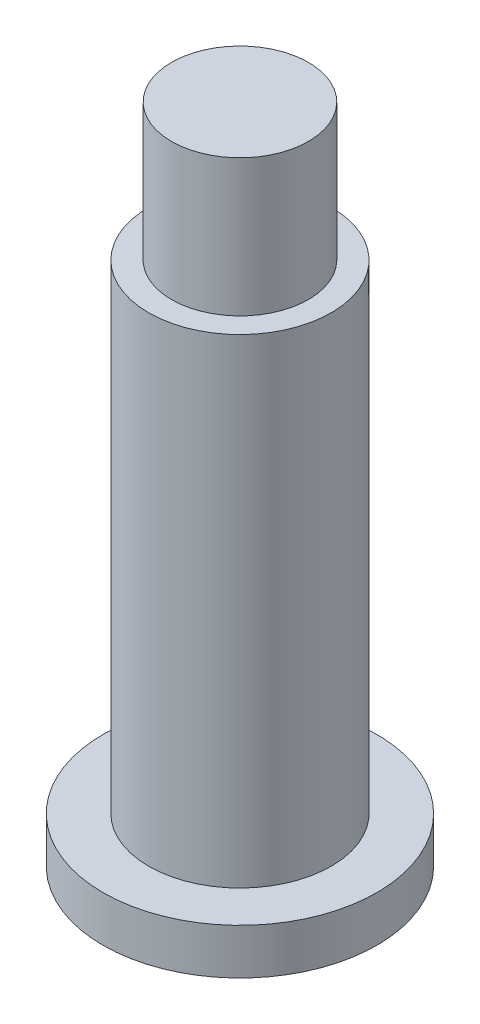
ISO-10303-21;
HEADER;
FILE_DESCRIPTION(('STEP AP214'),'2;1');
FILE_NAME('part.step','',(''),(''),'','','');
FILE_SCHEMA(('AUTOMOTIVE_DESIGN { 1 0 10303 214 1 1 1 1 }'));
ENDSEC;
DATA;
#1=APPLICATION_CONTEXT('core data for automotive mechanical design processes');
#2=APPLICATION_PROTOCOL_DEFINITION('international standard','automotive_design',2000,#1);
#3=PRODUCT_CONTEXT('',#1,'mechanical');
#4=PRODUCT('Part','Part','',(#3));
#5=PRODUCT_RELATED_PRODUCT_CATEGORY('part','',(#4));
#6=PRODUCT_DEFINITION_FORMATION('','',#4);
#7=PRODUCT_DEFINITION_CONTEXT('part definition',#1,'design');
#8=PRODUCT_DEFINITION('design','',#6,#7);
#9=PRODUCT_DEFINITION_SHAPE('','',#8);
#10=(LENGTH_UNIT() NAMED_UNIT(*) SI_UNIT(.MILLI.,.METRE.));
#11=(NAMED_UNIT(*) PLANE_ANGLE_UNIT() SI_UNIT($,.RADIAN.));
#12=(NAMED_UNIT(*) SI_UNIT($,.STERADIAN.) SOLID_ANGLE_UNIT());
#13=UNCERTAINTY_MEASURE_WITH_UNIT(LENGTH_MEASURE(1.E-05),#10,'distance_accuracy_value','');
#14=(GEOMETRIC_REPRESENTATION_CONTEXT(3) GLOBAL_UNCERTAINTY_ASSIGNED_CONTEXT((#13)) GLOBAL_UNIT_ASSIGNED_CONTEXT((#10,
#11,#12)) REPRESENTATION_CONTEXT('',''));
#15=CARTESIAN_POINT('',(0.,0.,0.));
#16=DIRECTION('',(0.,0.,1.));
#17=DIRECTION('',(1.,0.,0.));
#18=AXIS2_PLACEMENT_3D('',#15,#16,#17);
#19=CARTESIAN_POINT('',(0.,23.,0.));
#20=DIRECTION('',(0.,1.,0.));
#21=DIRECTION('',(0.,0.,1.));
#22=AXIS2_PLACEMENT_3D('',#19,#20,#21);
#23=PLANE('',#22);
#24=CARTESIAN_POINT('',(0.,23.,0.));
#25=DIRECTION('',(0.,1.,0.));
#26=DIRECTION('',(0.,0.,1.));
#27=AXIS2_PLACEMENT_3D('',#24,#25,#26);
#28=CIRCLE('',#27,4.);
#29=CARTESIAN_POINT('',(0.,23.,4.));
#30=VERTEX_POINT('',#29);
#31=EDGE_CURVE('E46',#30,#30,#28,.T.);
#32=ORIENTED_EDGE('',*,*,#31,.T.);
#33=EDGE_LOOP('',(#32));
#34=FACE_BOUND('',#33,.T.);
#35=CARTESIAN_POINT('',(0.,23.,0.));
#36=DIRECTION('',(0.,1.,0.));
#37=DIRECTION('',(0.,0.,1.));
#38=AXIS2_PLACEMENT_3D('',#35,#36,#37);
#39=CIRCLE('',#38,3.);
#40=CARTESIAN_POINT('',(0.,23.,3.));
#41=VERTEX_POINT('',#40);
#42=EDGE_CURVE('E54',#41,#41,#39,.T.);
#43=ORIENTED_EDGE('',*,*,#42,.F.);
#44=EDGE_LOOP('',(#43));
#45=FACE_BOUND('',#44,.T.);
#46=ADVANCED_FACE('F35',(#34,#45),#23,.T.);
#47=CARTESIAN_POINT('',(0.,2.,0.));
#48=DIRECTION('',(0.,1.,0.));
#49=DIRECTION('',(0.,0.,1.));
#50=AXIS2_PLACEMENT_3D('',#47,#48,#49);
#51=PLANE('',#50);
#52=CARTESIAN_POINT('',(0.,2.,0.));
#53=DIRECTION('',(0.,1.,0.));
#54=DIRECTION('',(0.,0.,1.));
#55=AXIS2_PLACEMENT_3D('',#52,#53,#54);
#56=CIRCLE('',#55,6.);
#57=CARTESIAN_POINT('',(0.,2.,6.));
#58=VERTEX_POINT('',#57);
#59=EDGE_CURVE('E10',#58,#58,#56,.T.);
#60=ORIENTED_EDGE('',*,*,#59,.T.);
#61=EDGE_LOOP('',(#60));
#62=FACE_BOUND('',#61,.T.);
#63=CARTESIAN_POINT('',(0.,2.,0.));
#64=DIRECTION('',(0.,1.,0.));
#65=DIRECTION('',(0.,0.,1.));
#66=AXIS2_PLACEMENT_3D('',#63,#64,#65);
#67=CIRCLE('',#66,4.);
#68=CARTESIAN_POINT('',(0.,2.,4.));
#69=VERTEX_POINT('',#68);
#70=EDGE_CURVE('E48',#69,#69,#67,.T.);
#71=ORIENTED_EDGE('',*,*,#70,.F.);
#72=EDGE_LOOP('',(#71));
#73=FACE_BOUND('',#72,.T.);
#74=ADVANCED_FACE('F70',(#62,#73),#51,.T.);
#75=CARTESIAN_POINT('',(0.,2.,0.));
#76=DIRECTION('',(0.,-1.,0.));
#77=DIRECTION('',(0.,0.,-1.));
#78=AXIS2_PLACEMENT_3D('',#75,#76,#77);
#79=CYLINDRICAL_SURFACE('',#78,6.);
#80=ORIENTED_EDGE('',*,*,#59,.F.);
#81=EDGE_LOOP('',(#80));
#82=FACE_BOUND('',#81,.T.);
#83=CARTESIAN_POINT('',(0.,0.,0.));
#84=DIRECTION('',(0.,1.,0.));
#85=DIRECTION('',(0.,0.,1.));
#86=AXIS2_PLACEMENT_3D('',#83,#84,#85);
#87=CIRCLE('',#86,6.);
#88=CARTESIAN_POINT('',(0.,0.,6.));
#89=VERTEX_POINT('',#88);
#90=EDGE_CURVE('E39',#89,#89,#87,.T.);
#91=ORIENTED_EDGE('',*,*,#90,.T.);
#92=EDGE_LOOP('',(#91));
#93=FACE_BOUND('',#92,.T.);
#94=ADVANCED_FACE('F37',(#82,#93),#79,.T.);
#95=CARTESIAN_POINT('',(0.,0.,0.));
#96=DIRECTION('',(0.,1.,0.));
#97=DIRECTION('',(0.,0.,1.));
#98=AXIS2_PLACEMENT_3D('',#95,#96,#97);
#99=PLANE('',#98);
#100=ORIENTED_EDGE('',*,*,#90,.F.);
#101=EDGE_LOOP('',(#100));
#102=FACE_BOUND('',#101,.T.);
#103=ADVANCED_FACE('F80',(#102),#99,.F.);
#104=CARTESIAN_POINT('',(0.,23.,0.));
#105=DIRECTION('',(0.,-1.,0.));
#106=DIRECTION('',(0.,0.,-1.));
#107=AXIS2_PLACEMENT_3D('',#104,#105,#106);
#108=CYLINDRICAL_SURFACE('',#107,4.);
#109=ORIENTED_EDGE('',*,*,#31,.F.);
#110=EDGE_LOOP('',(#109));
#111=FACE_BOUND('',#110,.T.);
#112=ORIENTED_EDGE('',*,*,#70,.T.);
#113=EDGE_LOOP('',(#112));
#114=FACE_BOUND('',#113,.T.);
#115=ADVANCED_FACE('F65',(#111,#114),#108,.T.);
#116=CARTESIAN_POINT('',(0.,29.,0.));
#117=DIRECTION('',(0.,-1.,0.));
#118=DIRECTION('',(0.,0.,-1.));
#119=AXIS2_PLACEMENT_3D('',#116,#117,#118);
#120=CYLINDRICAL_SURFACE('',#119,3.);
#121=CARTESIAN_POINT('',(0.,29.,0.));
#122=DIRECTION('',(0.,1.,0.));
#123=DIRECTION('',(0.,0.,1.));
#124=AXIS2_PLACEMENT_3D('',#121,#122,#123);
#125=CIRCLE('',#124,3.);
#126=CARTESIAN_POINT('',(0.,29.,3.));
#127=VERTEX_POINT('',#126);
#128=EDGE_CURVE('E51',#127,#127,#125,.T.);
#129=ORIENTED_EDGE('',*,*,#128,.F.);
#130=EDGE_LOOP('',(#129));
#131=FACE_BOUND('',#130,.T.);
#132=ORIENTED_EDGE('',*,*,#42,.T.);
#133=EDGE_LOOP('',(#132));
#134=FACE_BOUND('',#133,.T.);
#135=ADVANCED_FACE('F62',(#131,#134),#120,.T.);
#136=CARTESIAN_POINT('',(0.,29.,0.));
#137=DIRECTION('',(0.,1.,0.));
#138=DIRECTION('',(0.,0.,1.));
#139=AXIS2_PLACEMENT_3D('',#136,#137,#138);
#140=PLANE('',#139);
#141=ORIENTED_EDGE('',*,*,#128,.T.);
#142=EDGE_LOOP('',(#141));
#143=FACE_BOUND('',#142,.T.);
#144=ADVANCED_FACE('F60',(#143),#140,.T.);
#145=CLOSED_SHELL('',(#46,#74,#94,#103,#115,#135,#144));
#146=MANIFOLD_SOLID_BREP('B2',#145);
#147=ADVANCED_BREP_SHAPE_REPRESENTATION('',(#18,#146),#14);
#148=SHAPE_DEFINITION_REPRESENTATION(#9,#147);
ENDSEC;
END-ISO-10303-21;
